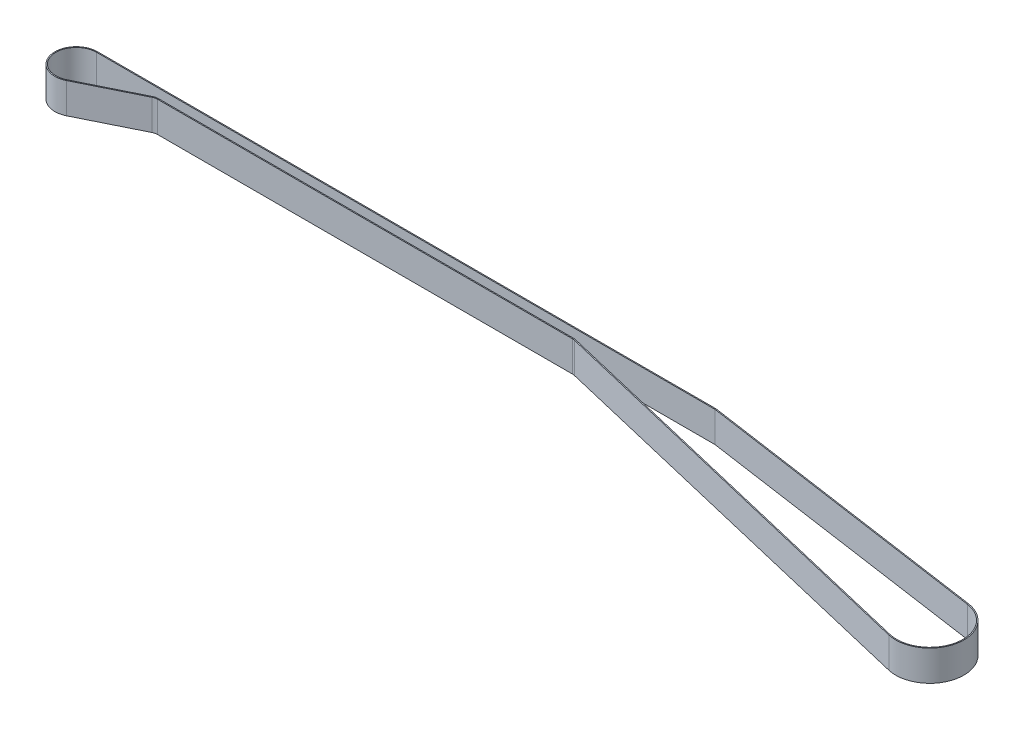
ISO-10303-21;
HEADER;
FILE_DESCRIPTION(('STEP AP214'),'2;1');
FILE_NAME('part.step','',(''),(''),'','','');
FILE_SCHEMA(('AUTOMOTIVE_DESIGN { 1 0 10303 214 1 1 1 1 }'));
ENDSEC;
DATA;
#1=APPLICATION_CONTEXT('core data for automotive mechanical design processes');
#2=APPLICATION_PROTOCOL_DEFINITION('international standard','automotive_design',2000,#1);
#3=PRODUCT_CONTEXT('',#1,'mechanical');
#4=PRODUCT('Part','Part','',(#3));
#5=PRODUCT_RELATED_PRODUCT_CATEGORY('part','',(#4));
#6=PRODUCT_DEFINITION_FORMATION('','',#4);
#7=PRODUCT_DEFINITION_CONTEXT('part definition',#1,'design');
#8=PRODUCT_DEFINITION('design','',#6,#7);
#9=PRODUCT_DEFINITION_SHAPE('','',#8);
#10=(LENGTH_UNIT() NAMED_UNIT(*) SI_UNIT(.MILLI.,.METRE.));
#11=(NAMED_UNIT(*) PLANE_ANGLE_UNIT() SI_UNIT($,.RADIAN.));
#12=(NAMED_UNIT(*) SI_UNIT($,.STERADIAN.) SOLID_ANGLE_UNIT());
#13=UNCERTAINTY_MEASURE_WITH_UNIT(LENGTH_MEASURE(1.E-05),#10,'distance_accuracy_value','');
#14=(GEOMETRIC_REPRESENTATION_CONTEXT(3) GLOBAL_UNCERTAINTY_ASSIGNED_CONTEXT((#13)) GLOBAL_UNIT_ASSIGNED_CONTEXT((#10,
#11,#12)) REPRESENTATION_CONTEXT('',''));
#15=CARTESIAN_POINT('',(0.,0.,0.));
#16=DIRECTION('',(0.,0.,1.));
#17=DIRECTION('',(1.,0.,0.));
#18=AXIS2_PLACEMENT_3D('',#15,#16,#17);
#19=CARTESIAN_POINT('',(0.,15.,0.));
#20=DIRECTION('',(0.,1.,0.));
#21=DIRECTION('',(0.,0.,1.));
#22=AXIS2_PLACEMENT_3D('',#19,#20,#21);
#23=PLANE('',#22);
#24=CARTESIAN_POINT('',(0.,15.,0.));
#25=DIRECTION('',(0.,1.,0.));
#26=DIRECTION('',(0.,0.,1.));
#27=AXIS2_PLACEMENT_3D('',#24,#25,#26);
#28=CIRCLE('',#27,10.5);
#29=CARTESIAN_POINT('',(0.,15.,-10.5));
#30=VERTEX_POINT('',#29);
#31=CARTESIAN_POINT('',(4.65,15.,9.41421797070792));
#32=VERTEX_POINT('',#31);
#33=EDGE_CURVE('E230',#30,#32,#28,.T.);
#34=ORIENTED_EDGE('',*,*,#33,.T.);
#35=DIRECTION('',(0.896592187686469,0.,-0.442857142857143));
#36=VECTOR('',#35,1.);
#37=CARTESIAN_POINT('',(4.65,15.,9.41421797070792));
#38=LINE('',#37,#36);
#39=CARTESIAN_POINT('',(32.7857142857143,15.,-4.48296093843234));
#40=VERTEX_POINT('',#39);
#41=EDGE_CURVE('E233',#32,#40,#38,.T.);
#42=ORIENTED_EDGE('',*,*,#41,.T.);
#43=CARTESIAN_POINT('',(35.,15.,0.));
#44=DIRECTION('',(0.,-1.,0.));
#45=DIRECTION('',(0.,0.,1.));
#46=AXIS2_PLACEMENT_3D('',#43,#44,#45);
#47=CIRCLE('',#46,5.);
#48=CARTESIAN_POINT('',(35.,15.,-5.));
#49=VERTEX_POINT('',#48);
#50=EDGE_CURVE('E236',#40,#49,#47,.T.);
#51=ORIENTED_EDGE('',*,*,#50,.T.);
#52=DIRECTION('',(1.,0.,0.));
#53=VECTOR('',#52,1.);
#54=CARTESIAN_POINT('',(35.,15.,-5.));
#55=LINE('',#54,#53);
#56=CARTESIAN_POINT('',(238.84,15.,-4.99999999999999));
#57=VERTEX_POINT('',#56);
#58=EDGE_CURVE('E238',#49,#57,#55,.T.);
#59=ORIENTED_EDGE('',*,*,#58,.T.);
#60=CARTESIAN_POINT('',(238.84,15.,0.));
#61=DIRECTION('',(0.,-1.,0.));
#62=DIRECTION('',(0.,0.,1.));
#63=AXIS2_PLACEMENT_3D('',#60,#61,#62);
#64=CIRCLE('',#63,4.99999999999999);
#65=CARTESIAN_POINT('',(239.996066619357,15.,-4.86451538918415));
#66=VERTEX_POINT('',#65);
#67=EDGE_CURVE('E240',#57,#66,#64,.T.);
#68=ORIENTED_EDGE('',*,*,#67,.T.);
#69=DIRECTION('',(0.972903077836831,0.,0.231213323871314));
#70=VECTOR('',#69,1.);
#71=CARTESIAN_POINT('',(239.996066619357,15.,-4.86451538918415));
#72=LINE('',#71,#70);
#73=CARTESIAN_POINT('',(442.647176825156,15.,43.2961265537669));
#74=VERTEX_POINT('',#73);
#75=EDGE_CURVE('E242',#66,#74,#72,.T.);
#76=ORIENTED_EDGE('',*,*,#75,.T.);
#77=CARTESIAN_POINT('',(446.52,15.,27.));
#78=DIRECTION('',(0.,1.,0.));
#79=DIRECTION('',(0.,0.,1.));
#80=AXIS2_PLACEMENT_3D('',#77,#78,#79);
#81=CIRCLE('',#80,16.75);
#82=CARTESIAN_POINT('',(448.913075842957,15.,10.4218309813824));
#83=VERTEX_POINT('',#82);
#84=EDGE_CURVE('E244',#74,#83,#81,.T.);
#85=ORIENTED_EDGE('',*,*,#84,.T.);
#86=DIRECTION('',(-0.989741433947323,0.,-0.142870199579541));
#87=VECTOR('',#86,1.);
#88=CARTESIAN_POINT('',(303.975901699875,15.,-10.5));
#89=LINE('',#88,#87);
#90=CARTESIAN_POINT('',(303.975901699875,15.,-10.5));
#91=VERTEX_POINT('',#90);
#92=EDGE_CURVE('E246',#83,#91,#89,.T.);
#93=ORIENTED_EDGE('',*,*,#92,.T.);
#94=DIRECTION('',(-1.,0.,0.));
#95=VECTOR('',#94,1.);
#96=CARTESIAN_POINT('',(0.,15.,-10.5));
#97=LINE('',#96,#95);
#98=EDGE_CURVE('E248',#91,#30,#97,.T.);
#99=ORIENTED_EDGE('',*,*,#98,.T.);
#100=EDGE_LOOP('',(#34,#42,#51,#59,#68,#76,#85,#93,#99));
#101=FACE_BOUND('',#100,.T.);
#102=DIRECTION('',(0.896592187686469,0.,-0.442857142857143));
#103=VECTOR('',#102,1.);
#104=CARTESIAN_POINT('',(4.42857142857143,15.,8.96592187686469));
#105=LINE('',#104,#103);
#106=CARTESIAN_POINT('',(4.42857142857143,15.,8.96592187686469));
#107=VERTEX_POINT('',#106);
#108=CARTESIAN_POINT('',(32.5642857142857,15.,-4.93125703227558));
#109=VERTEX_POINT('',#108);
#110=EDGE_CURVE('E166',#107,#109,#105,.T.);
#111=ORIENTED_EDGE('',*,*,#110,.F.);
#112=CARTESIAN_POINT('',(0.,15.,0.));
#113=DIRECTION('',(0.,1.,0.));
#114=DIRECTION('',(0.,0.,1.));
#115=AXIS2_PLACEMENT_3D('',#112,#113,#114);
#116=CIRCLE('',#115,10.);
#117=CARTESIAN_POINT('',(0.,15.,-10.));
#118=VERTEX_POINT('',#117);
#119=EDGE_CURVE('E158',#118,#107,#116,.T.);
#120=ORIENTED_EDGE('',*,*,#119,.F.);
#121=DIRECTION('',(-1.,0.,0.));
#122=VECTOR('',#121,1.);
#123=CARTESIAN_POINT('',(0.,15.,-10.));
#124=LINE('',#123,#122);
#125=CARTESIAN_POINT('',(303.94,15.,-10.));
#126=VERTEX_POINT('',#125);
#127=EDGE_CURVE('E193',#126,#118,#124,.T.);
#128=ORIENTED_EDGE('',*,*,#127,.F.);
#129=DIRECTION('',(-0.989741433947323,0.,-0.142870199579541));
#130=VECTOR('',#129,1.);
#131=CARTESIAN_POINT('',(303.94,15.,-10.));
#132=LINE('',#131,#130);
#133=CARTESIAN_POINT('',(448.841640743168,15.,10.916701698356));
#134=VERTEX_POINT('',#133);
#135=EDGE_CURVE('E191',#134,#126,#132,.T.);
#136=ORIENTED_EDGE('',*,*,#135,.F.);
#137=CARTESIAN_POINT('',(446.52,15.,27.));
#138=DIRECTION('',(0.,1.,0.));
#139=DIRECTION('',(0.,0.,1.));
#140=AXIS2_PLACEMENT_3D('',#137,#138,#139);
#141=CIRCLE('',#140,16.25);
#142=CARTESIAN_POINT('',(442.762783487091,15.,42.8096750148485));
#143=VERTEX_POINT('',#142);
#144=EDGE_CURVE('E189',#143,#134,#141,.T.);
#145=ORIENTED_EDGE('',*,*,#144,.F.);
#146=DIRECTION('',(0.972903077836831,0.,0.231213323871314));
#147=VECTOR('',#146,1.);
#148=CARTESIAN_POINT('',(240.111673281292,15.,-5.35096692810256));
#149=LINE('',#148,#147);
#150=CARTESIAN_POINT('',(240.111673281292,15.,-5.35096692810256));
#151=VERTEX_POINT('',#150);
#152=EDGE_CURVE('E187',#151,#143,#149,.T.);
#153=ORIENTED_EDGE('',*,*,#152,.F.);
#154=CARTESIAN_POINT('',(238.84,15.,0.));
#155=DIRECTION('',(0.,-1.,0.));
#156=DIRECTION('',(0.,0.,1.));
#157=AXIS2_PLACEMENT_3D('',#154,#155,#156);
#158=CIRCLE('',#157,5.49999999999999);
#159=CARTESIAN_POINT('',(238.84,15.,-5.49999999999999));
#160=VERTEX_POINT('',#159);
#161=EDGE_CURVE('E185',#160,#151,#158,.T.);
#162=ORIENTED_EDGE('',*,*,#161,.F.);
#163=DIRECTION('',(1.,0.,0.));
#164=VECTOR('',#163,1.);
#165=CARTESIAN_POINT('',(35.,15.,-5.5));
#166=LINE('',#165,#164);
#167=CARTESIAN_POINT('',(35.,15.,-5.5));
#168=VERTEX_POINT('',#167);
#169=EDGE_CURVE('E181',#168,#160,#166,.T.);
#170=ORIENTED_EDGE('',*,*,#169,.F.);
#171=CARTESIAN_POINT('',(35.,15.,0.));
#172=DIRECTION('',(0.,-1.,0.));
#173=DIRECTION('',(0.,0.,1.));
#174=AXIS2_PLACEMENT_3D('',#171,#172,#173);
#175=CIRCLE('',#174,5.5);
#176=EDGE_CURVE('E179',#109,#168,#175,.T.);
#177=ORIENTED_EDGE('',*,*,#176,.F.);
#178=EDGE_LOOP('',(#111,#120,#128,#136,#145,#153,#162,#170,#177));
#179=FACE_BOUND('',#178,.T.);
#180=ADVANCED_FACE('F33',(#101,#179),#23,.T.);
#181=CARTESIAN_POINT('',(0.,0.,0.));
#182=DIRECTION('',(0.,1.,0.));
#183=DIRECTION('',(0.,0.,1.));
#184=AXIS2_PLACEMENT_3D('',#181,#182,#183);
#185=PLANE('',#184);
#186=CARTESIAN_POINT('',(0.,0.,0.));
#187=DIRECTION('',(0.,1.,0.));
#188=DIRECTION('',(0.,0.,1.));
#189=AXIS2_PLACEMENT_3D('',#186,#187,#188);
#190=CIRCLE('',#189,10.5);
#191=CARTESIAN_POINT('',(0.,0.,-10.5));
#192=VERTEX_POINT('',#191);
#193=CARTESIAN_POINT('',(4.65,0.,9.41421797070792));
#194=VERTEX_POINT('',#193);
#195=EDGE_CURVE('E174',#192,#194,#190,.T.);
#196=ORIENTED_EDGE('',*,*,#195,.F.);
#197=DIRECTION('',(-1.,0.,0.));
#198=VECTOR('',#197,1.);
#199=CARTESIAN_POINT('',(0.,0.,-10.5));
#200=LINE('',#199,#198);
#201=CARTESIAN_POINT('',(303.975901699875,0.,-10.5));
#202=VERTEX_POINT('',#201);
#203=EDGE_CURVE('E234',#202,#192,#200,.T.);
#204=ORIENTED_EDGE('',*,*,#203,.F.);
#205=DIRECTION('',(-0.989741433947323,0.,-0.142870199579541));
#206=VECTOR('',#205,1.);
#207=CARTESIAN_POINT('',(303.975901699875,0.,-10.5));
#208=LINE('',#207,#206);
#209=CARTESIAN_POINT('',(448.913075842957,0.,10.4218309813824));
#210=VERTEX_POINT('',#209);
#211=EDGE_CURVE('E265',#210,#202,#208,.T.);
#212=ORIENTED_EDGE('',*,*,#211,.F.);
#213=CARTESIAN_POINT('',(446.52,0.,27.));
#214=DIRECTION('',(0.,1.,0.));
#215=DIRECTION('',(0.,0.,1.));
#216=AXIS2_PLACEMENT_3D('',#213,#214,#215);
#217=CIRCLE('',#216,16.75);
#218=CARTESIAN_POINT('',(442.647176825156,0.,43.2961265537669));
#219=VERTEX_POINT('',#218);
#220=EDGE_CURVE('E263',#219,#210,#217,.T.);
#221=ORIENTED_EDGE('',*,*,#220,.F.);
#222=DIRECTION('',(0.972903077836831,0.,0.231213323871314));
#223=VECTOR('',#222,1.);
#224=CARTESIAN_POINT('',(239.996066619357,0.,-4.86451538918415));
#225=LINE('',#224,#223);
#226=CARTESIAN_POINT('',(239.996066619357,0.,-4.86451538918415));
#227=VERTEX_POINT('',#226);
#228=EDGE_CURVE('E261',#227,#219,#225,.T.);
#229=ORIENTED_EDGE('',*,*,#228,.F.);
#230=CARTESIAN_POINT('',(238.84,0.,0.));
#231=DIRECTION('',(0.,-1.,0.));
#232=DIRECTION('',(0.,0.,1.));
#233=AXIS2_PLACEMENT_3D('',#230,#231,#232);
#234=CIRCLE('',#233,4.99999999999999);
#235=CARTESIAN_POINT('',(238.84,0.,-4.99999999999999));
#236=VERTEX_POINT('',#235);
#237=EDGE_CURVE('E259',#236,#227,#234,.T.);
#238=ORIENTED_EDGE('',*,*,#237,.F.);
#239=DIRECTION('',(1.,0.,0.));
#240=VECTOR('',#239,1.);
#241=CARTESIAN_POINT('',(35.,0.,-5.));
#242=LINE('',#241,#240);
#243=CARTESIAN_POINT('',(35.,0.,-5.));
#244=VERTEX_POINT('',#243);
#245=EDGE_CURVE('E257',#244,#236,#242,.T.);
#246=ORIENTED_EDGE('',*,*,#245,.F.);
#247=CARTESIAN_POINT('',(35.,0.,0.));
#248=DIRECTION('',(0.,-1.,0.));
#249=DIRECTION('',(0.,0.,1.));
#250=AXIS2_PLACEMENT_3D('',#247,#248,#249);
#251=CIRCLE('',#250,5.);
#252=CARTESIAN_POINT('',(32.7857142857143,0.,-4.48296093843234));
#253=VERTEX_POINT('',#252);
#254=EDGE_CURVE('E255',#253,#244,#251,.T.);
#255=ORIENTED_EDGE('',*,*,#254,.F.);
#256=DIRECTION('',(0.896592187686469,0.,-0.442857142857143));
#257=VECTOR('',#256,1.);
#258=CARTESIAN_POINT('',(4.65,0.,9.41421797070792));
#259=LINE('',#258,#257);
#260=EDGE_CURVE('E253',#194,#253,#259,.T.);
#261=ORIENTED_EDGE('',*,*,#260,.F.);
#262=EDGE_LOOP('',(#196,#204,#212,#221,#229,#238,#246,#255,#261));
#263=FACE_BOUND('',#262,.T.);
#264=CARTESIAN_POINT('',(0.,0.,0.));
#265=DIRECTION('',(0.,1.,0.));
#266=DIRECTION('',(0.,0.,1.));
#267=AXIS2_PLACEMENT_3D('',#264,#265,#266);
#268=CIRCLE('',#267,10.);
#269=CARTESIAN_POINT('',(0.,0.,-10.));
#270=VERTEX_POINT('',#269);
#271=CARTESIAN_POINT('',(4.42857142857143,0.,8.96592187686469));
#272=VERTEX_POINT('',#271);
#273=EDGE_CURVE('E56',#270,#272,#268,.T.);
#274=ORIENTED_EDGE('',*,*,#273,.T.);
#275=DIRECTION('',(0.896592187686469,0.,-0.442857142857143));
#276=VECTOR('',#275,1.);
#277=CARTESIAN_POINT('',(4.42857142857143,0.,8.96592187686469));
#278=LINE('',#277,#276);
#279=CARTESIAN_POINT('',(32.5642857142857,0.,-4.93125703227558));
#280=VERTEX_POINT('',#279);
#281=EDGE_CURVE('E173',#272,#280,#278,.T.);
#282=ORIENTED_EDGE('',*,*,#281,.T.);
#283=CARTESIAN_POINT('',(35.,0.,0.));
#284=DIRECTION('',(0.,-1.,0.));
#285=DIRECTION('',(0.,0.,1.));
#286=AXIS2_PLACEMENT_3D('',#283,#284,#285);
#287=CIRCLE('',#286,5.5);
#288=CARTESIAN_POINT('',(35.,0.,-5.5));
#289=VERTEX_POINT('',#288);
#290=EDGE_CURVE('E197',#280,#289,#287,.T.);
#291=ORIENTED_EDGE('',*,*,#290,.T.);
#292=DIRECTION('',(1.,0.,0.));
#293=VECTOR('',#292,1.);
#294=CARTESIAN_POINT('',(35.,0.,-5.5));
#295=LINE('',#294,#293);
#296=CARTESIAN_POINT('',(238.84,0.,-5.49999999999999));
#297=VERTEX_POINT('',#296);
#298=EDGE_CURVE('E200',#289,#297,#295,.T.);
#299=ORIENTED_EDGE('',*,*,#298,.T.);
#300=CARTESIAN_POINT('',(238.84,0.,0.));
#301=DIRECTION('',(0.,-1.,0.));
#302=DIRECTION('',(0.,0.,1.));
#303=AXIS2_PLACEMENT_3D('',#300,#301,#302);
#304=CIRCLE('',#303,5.49999999999999);
#305=CARTESIAN_POINT('',(240.111673281292,0.,-5.35096692810256));
#306=VERTEX_POINT('',#305);
#307=EDGE_CURVE('E203',#297,#306,#304,.T.);
#308=ORIENTED_EDGE('',*,*,#307,.T.);
#309=DIRECTION('',(0.972903077836831,0.,0.231213323871314));
#310=VECTOR('',#309,1.);
#311=CARTESIAN_POINT('',(240.111673281292,0.,-5.35096692810256));
#312=LINE('',#311,#310);
#313=CARTESIAN_POINT('',(442.762783487091,0.,42.8096750148485));
#314=VERTEX_POINT('',#313);
#315=EDGE_CURVE('E206',#306,#314,#312,.T.);
#316=ORIENTED_EDGE('',*,*,#315,.T.);
#317=CARTESIAN_POINT('',(446.52,0.,27.));
#318=DIRECTION('',(0.,1.,0.));
#319=DIRECTION('',(0.,0.,1.));
#320=AXIS2_PLACEMENT_3D('',#317,#318,#319);
#321=CIRCLE('',#320,16.25);
#322=CARTESIAN_POINT('',(448.841640743168,0.,10.916701698356));
#323=VERTEX_POINT('',#322);
#324=EDGE_CURVE('E209',#314,#323,#321,.T.);
#325=ORIENTED_EDGE('',*,*,#324,.T.);
#326=DIRECTION('',(-0.989741433947323,0.,-0.142870199579541));
#327=VECTOR('',#326,1.);
#328=CARTESIAN_POINT('',(303.94,0.,-10.));
#329=LINE('',#328,#327);
#330=CARTESIAN_POINT('',(303.94,0.,-10.));
#331=VERTEX_POINT('',#330);
#332=EDGE_CURVE('E212',#323,#331,#329,.T.);
#333=ORIENTED_EDGE('',*,*,#332,.T.);
#334=DIRECTION('',(-1.,0.,0.));
#335=VECTOR('',#334,1.);
#336=CARTESIAN_POINT('',(0.,0.,-10.));
#337=LINE('',#336,#335);
#338=EDGE_CURVE('E167',#331,#270,#337,.T.);
#339=ORIENTED_EDGE('',*,*,#338,.T.);
#340=EDGE_LOOP('',(#274,#282,#291,#299,#308,#316,#325,#333,#339));
#341=FACE_BOUND('',#340,.T.);
#342=ADVANCED_FACE('F298',(#263,#341),#185,.F.);
#343=CARTESIAN_POINT('',(0.,15.,0.));
#344=DIRECTION('',(0.,-1.,0.));
#345=DIRECTION('',(0.,0.,-1.));
#346=AXIS2_PLACEMENT_3D('',#343,#344,#345);
#347=CYLINDRICAL_SURFACE('',#346,10.5);
#348=ORIENTED_EDGE('',*,*,#195,.T.);
#349=DIRECTION('',(0.,-1.,0.));
#350=VECTOR('',#349,1.);
#351=CARTESIAN_POINT('',(4.65,15.,9.41421797070792));
#352=LINE('',#351,#350);
#353=EDGE_CURVE('E11',#32,#194,#352,.T.);
#354=ORIENTED_EDGE('',*,*,#353,.F.);
#355=ORIENTED_EDGE('',*,*,#33,.F.);
#356=DIRECTION('',(0.,-1.,0.));
#357=VECTOR('',#356,1.);
#358=CARTESIAN_POINT('',(0.,15.,-10.5));
#359=LINE('',#358,#357);
#360=EDGE_CURVE('E250',#30,#192,#359,.T.);
#361=ORIENTED_EDGE('',*,*,#360,.T.);
#362=EDGE_LOOP('',(#348,#354,#355,#361));
#363=FACE_BOUND('',#362,.T.);
#364=ADVANCED_FACE('F35',(#363),#347,.T.);
#365=CARTESIAN_POINT('',(4.65,15.,9.41421797070792));
#366=DIRECTION('',(-0.442857142857143,0.,-0.896592187686469));
#367=DIRECTION('',(-0.896592187686469,0.,0.442857142857143));
#368=AXIS2_PLACEMENT_3D('',#365,#366,#367);
#369=PLANE('',#368);
#370=ORIENTED_EDGE('',*,*,#260,.T.);
#371=DIRECTION('',(0.,-1.,0.));
#372=VECTOR('',#371,1.);
#373=CARTESIAN_POINT('',(32.7857142857143,15.,-4.48296093843234));
#374=LINE('',#373,#372);
#375=EDGE_CURVE('E41',#40,#253,#374,.T.);
#376=ORIENTED_EDGE('',*,*,#375,.F.);
#377=ORIENTED_EDGE('',*,*,#41,.F.);
#378=ORIENTED_EDGE('',*,*,#353,.T.);
#379=EDGE_LOOP('',(#370,#376,#377,#378));
#380=FACE_BOUND('',#379,.T.);
#381=ADVANCED_FACE('F315',(#380),#369,.F.);
#382=CARTESIAN_POINT('',(35.,15.,0.));
#383=DIRECTION('',(0.,-1.,0.));
#384=DIRECTION('',(0.,0.,-1.));
#385=AXIS2_PLACEMENT_3D('',#382,#383,#384);
#386=CYLINDRICAL_SURFACE('',#385,5.);
#387=ORIENTED_EDGE('',*,*,#254,.T.);
#388=DIRECTION('',(0.,-1.,0.));
#389=VECTOR('',#388,1.);
#390=CARTESIAN_POINT('',(35.,15.,-5.));
#391=LINE('',#390,#389);
#392=EDGE_CURVE('E285',#49,#244,#391,.T.);
#393=ORIENTED_EDGE('',*,*,#392,.F.);
#394=ORIENTED_EDGE('',*,*,#50,.F.);
#395=ORIENTED_EDGE('',*,*,#375,.T.);
#396=EDGE_LOOP('',(#387,#393,#394,#395));
#397=FACE_BOUND('',#396,.T.);
#398=ADVANCED_FACE('F292',(#397),#386,.F.);
#399=CARTESIAN_POINT('',(35.,15.,-5.));
#400=DIRECTION('',(0.,0.,-1.));
#401=DIRECTION('',(-1.,0.,0.));
#402=AXIS2_PLACEMENT_3D('',#399,#400,#401);
#403=PLANE('',#402);
#404=ORIENTED_EDGE('',*,*,#245,.T.);
#405=DIRECTION('',(0.,-1.,0.));
#406=VECTOR('',#405,1.);
#407=CARTESIAN_POINT('',(238.84,15.,-4.99999999999999));
#408=LINE('',#407,#406);
#409=EDGE_CURVE('E282',#57,#236,#408,.T.);
#410=ORIENTED_EDGE('',*,*,#409,.F.);
#411=ORIENTED_EDGE('',*,*,#58,.F.);
#412=ORIENTED_EDGE('',*,*,#392,.T.);
#413=EDGE_LOOP('',(#404,#410,#411,#412));
#414=FACE_BOUND('',#413,.T.);
#415=ADVANCED_FACE('F304',(#414),#403,.F.);
#416=CARTESIAN_POINT('',(238.84,15.,0.));
#417=DIRECTION('',(0.,-1.,0.));
#418=DIRECTION('',(0.,0.,-1.));
#419=AXIS2_PLACEMENT_3D('',#416,#417,#418);
#420=CYLINDRICAL_SURFACE('',#419,4.99999999999999);
#421=ORIENTED_EDGE('',*,*,#237,.T.);
#422=DIRECTION('',(0.,-1.,0.));
#423=VECTOR('',#422,1.);
#424=CARTESIAN_POINT('',(239.996066619357,15.,-4.86451538918415));
#425=LINE('',#424,#423);
#426=EDGE_CURVE('E279',#66,#227,#425,.T.);
#427=ORIENTED_EDGE('',*,*,#426,.F.);
#428=ORIENTED_EDGE('',*,*,#67,.F.);
#429=ORIENTED_EDGE('',*,*,#409,.T.);
#430=EDGE_LOOP('',(#421,#427,#428,#429));
#431=FACE_BOUND('',#430,.T.);
#432=ADVANCED_FACE('F308',(#431),#420,.F.);
#433=CARTESIAN_POINT('',(239.996066619357,15.,-4.86451538918415));
#434=DIRECTION('',(0.231213323871314,0.,-0.972903077836831));
#435=DIRECTION('',(-0.972903077836831,0.,-0.231213323871314));
#436=AXIS2_PLACEMENT_3D('',#433,#434,#435);
#437=PLANE('',#436);
#438=ORIENTED_EDGE('',*,*,#228,.T.);
#439=DIRECTION('',(0.,-1.,0.));
#440=VECTOR('',#439,1.);
#441=CARTESIAN_POINT('',(442.647176825156,15.,43.2961265537669));
#442=LINE('',#441,#440);
#443=EDGE_CURVE('E276',#74,#219,#442,.T.);
#444=ORIENTED_EDGE('',*,*,#443,.F.);
#445=ORIENTED_EDGE('',*,*,#75,.F.);
#446=ORIENTED_EDGE('',*,*,#426,.T.);
#447=EDGE_LOOP('',(#438,#444,#445,#446));
#448=FACE_BOUND('',#447,.T.);
#449=ADVANCED_FACE('F333',(#448),#437,.F.);
#450=CARTESIAN_POINT('',(446.52,15.,27.));
#451=DIRECTION('',(0.,-1.,0.));
#452=DIRECTION('',(0.,0.,-1.));
#453=AXIS2_PLACEMENT_3D('',#450,#451,#452);
#454=CYLINDRICAL_SURFACE('',#453,16.75);
#455=ORIENTED_EDGE('',*,*,#220,.T.);
#456=DIRECTION('',(0.,-1.,0.));
#457=VECTOR('',#456,1.);
#458=CARTESIAN_POINT('',(448.913075842957,15.,10.4218309813824));
#459=LINE('',#458,#457);
#460=EDGE_CURVE('E273',#83,#210,#459,.T.);
#461=ORIENTED_EDGE('',*,*,#460,.F.);
#462=ORIENTED_EDGE('',*,*,#84,.F.);
#463=ORIENTED_EDGE('',*,*,#443,.T.);
#464=EDGE_LOOP('',(#455,#461,#462,#463));
#465=FACE_BOUND('',#464,.T.);
#466=ADVANCED_FACE('F331',(#465),#454,.T.);
#467=CARTESIAN_POINT('',(303.975901699875,15.,-10.5));
#468=DIRECTION('',(-0.142870199579541,0.,0.989741433947322));
#469=DIRECTION('',(0.989741433947323,0.,0.142870199579541));
#470=AXIS2_PLACEMENT_3D('',#467,#468,#469);
#471=PLANE('',#470);
#472=ORIENTED_EDGE('',*,*,#211,.T.);
#473=DIRECTION('',(0.,-1.,0.));
#474=VECTOR('',#473,1.);
#475=CARTESIAN_POINT('',(303.975901699875,15.,-10.5));
#476=LINE('',#475,#474);
#477=EDGE_CURVE('E270',#91,#202,#476,.T.);
#478=ORIENTED_EDGE('',*,*,#477,.F.);
#479=ORIENTED_EDGE('',*,*,#92,.F.);
#480=ORIENTED_EDGE('',*,*,#460,.T.);
#481=EDGE_LOOP('',(#472,#478,#479,#480));
#482=FACE_BOUND('',#481,.T.);
#483=ADVANCED_FACE('F327',(#482),#471,.F.);
#484=CARTESIAN_POINT('',(0.,15.,-10.5));
#485=DIRECTION('',(0.,0.,1.));
#486=DIRECTION('',(1.,0.,0.));
#487=AXIS2_PLACEMENT_3D('',#484,#485,#486);
#488=PLANE('',#487);
#489=ORIENTED_EDGE('',*,*,#203,.T.);
#490=ORIENTED_EDGE('',*,*,#360,.F.);
#491=ORIENTED_EDGE('',*,*,#98,.F.);
#492=ORIENTED_EDGE('',*,*,#477,.T.);
#493=EDGE_LOOP('',(#489,#490,#491,#492));
#494=FACE_BOUND('',#493,.T.);
#495=ADVANCED_FACE('F322',(#494),#488,.F.);
#496=CARTESIAN_POINT('',(0.,15.,0.));
#497=DIRECTION('',(0.,-1.,0.));
#498=DIRECTION('',(0.,0.,-1.));
#499=AXIS2_PLACEMENT_3D('',#496,#497,#498);
#500=CYLINDRICAL_SURFACE('',#499,10.);
#501=ORIENTED_EDGE('',*,*,#273,.F.);
#502=DIRECTION('',(0.,-1.,0.));
#503=VECTOR('',#502,1.);
#504=CARTESIAN_POINT('',(0.,15.,-10.));
#505=LINE('',#504,#503);
#506=EDGE_CURVE('E162',#118,#270,#505,.T.);
#507=ORIENTED_EDGE('',*,*,#506,.F.);
#508=ORIENTED_EDGE('',*,*,#119,.T.);
#509=DIRECTION('',(0.,-1.,0.));
#510=VECTOR('',#509,1.);
#511=CARTESIAN_POINT('',(4.42857142857143,15.,8.96592187686469));
#512=LINE('',#511,#510);
#513=EDGE_CURVE('E161',#107,#272,#512,.T.);
#514=ORIENTED_EDGE('',*,*,#513,.T.);
#515=EDGE_LOOP('',(#501,#507,#508,#514));
#516=FACE_BOUND('',#515,.T.);
#517=ADVANCED_FACE('F160',(#516),#500,.F.);
#518=CARTESIAN_POINT('',(4.42857142857143,15.,8.96592187686469));
#519=DIRECTION('',(-0.442857142857143,0.,-0.896592187686469));
#520=DIRECTION('',(-0.896592187686469,0.,0.442857142857143));
#521=AXIS2_PLACEMENT_3D('',#518,#519,#520);
#522=PLANE('',#521);
#523=ORIENTED_EDGE('',*,*,#281,.F.);
#524=ORIENTED_EDGE('',*,*,#513,.F.);
#525=ORIENTED_EDGE('',*,*,#110,.T.);
#526=DIRECTION('',(0.,-1.,0.));
#527=VECTOR('',#526,1.);
#528=CARTESIAN_POINT('',(32.5642857142857,15.,-4.93125703227558));
#529=LINE('',#528,#527);
#530=EDGE_CURVE('E175',#109,#280,#529,.T.);
#531=ORIENTED_EDGE('',*,*,#530,.T.);
#532=EDGE_LOOP('',(#523,#524,#525,#531));
#533=FACE_BOUND('',#532,.T.);
#534=ADVANCED_FACE('F170',(#533),#522,.T.);
#535=CARTESIAN_POINT('',(35.,15.,0.));
#536=DIRECTION('',(0.,-1.,0.));
#537=DIRECTION('',(0.,0.,-1.));
#538=AXIS2_PLACEMENT_3D('',#535,#536,#537);
#539=CYLINDRICAL_SURFACE('',#538,5.5);
#540=ORIENTED_EDGE('',*,*,#290,.F.);
#541=ORIENTED_EDGE('',*,*,#530,.F.);
#542=ORIENTED_EDGE('',*,*,#176,.T.);
#543=DIRECTION('',(0.,-1.,0.));
#544=VECTOR('',#543,1.);
#545=CARTESIAN_POINT('',(35.,15.,-5.5));
#546=LINE('',#545,#544);
#547=EDGE_CURVE('E227',#168,#289,#546,.T.);
#548=ORIENTED_EDGE('',*,*,#547,.T.);
#549=EDGE_LOOP('',(#540,#541,#542,#548));
#550=FACE_BOUND('',#549,.T.);
#551=ADVANCED_FACE('F373',(#550),#539,.T.);
#552=CARTESIAN_POINT('',(35.,15.,-5.5));
#553=DIRECTION('',(0.,0.,-1.));
#554=DIRECTION('',(-1.,0.,0.));
#555=AXIS2_PLACEMENT_3D('',#552,#553,#554);
#556=PLANE('',#555);
#557=ORIENTED_EDGE('',*,*,#298,.F.);
#558=ORIENTED_EDGE('',*,*,#547,.F.);
#559=ORIENTED_EDGE('',*,*,#169,.T.);
#560=DIRECTION('',(0.,-1.,0.));
#561=VECTOR('',#560,1.);
#562=CARTESIAN_POINT('',(238.84,15.,-5.49999999999999));
#563=LINE('',#562,#561);
#564=EDGE_CURVE('E225',#160,#297,#563,.T.);
#565=ORIENTED_EDGE('',*,*,#564,.T.);
#566=EDGE_LOOP('',(#557,#558,#559,#565));
#567=FACE_BOUND('',#566,.T.);
#568=ADVANCED_FACE('F379',(#567),#556,.T.);
#569=CARTESIAN_POINT('',(238.84,15.,0.));
#570=DIRECTION('',(0.,-1.,0.));
#571=DIRECTION('',(0.,0.,-1.));
#572=AXIS2_PLACEMENT_3D('',#569,#570,#571);
#573=CYLINDRICAL_SURFACE('',#572,5.49999999999999);
#574=ORIENTED_EDGE('',*,*,#307,.F.);
#575=ORIENTED_EDGE('',*,*,#564,.F.);
#576=ORIENTED_EDGE('',*,*,#161,.T.);
#577=DIRECTION('',(0.,-1.,0.));
#578=VECTOR('',#577,1.);
#579=CARTESIAN_POINT('',(240.111673281292,15.,-5.35096692810256));
#580=LINE('',#579,#578);
#581=EDGE_CURVE('E223',#151,#306,#580,.T.);
#582=ORIENTED_EDGE('',*,*,#581,.T.);
#583=EDGE_LOOP('',(#574,#575,#576,#582));
#584=FACE_BOUND('',#583,.T.);
#585=ADVANCED_FACE('F387',(#584),#573,.T.);
#586=CARTESIAN_POINT('',(240.111673281292,15.,-5.35096692810256));
#587=DIRECTION('',(0.231213323871314,0.,-0.972903077836831));
#588=DIRECTION('',(-0.972903077836831,0.,-0.231213323871314));
#589=AXIS2_PLACEMENT_3D('',#586,#587,#588);
#590=PLANE('',#589);
#591=ORIENTED_EDGE('',*,*,#315,.F.);
#592=ORIENTED_EDGE('',*,*,#581,.F.);
#593=ORIENTED_EDGE('',*,*,#152,.T.);
#594=DIRECTION('',(0.,-1.,0.));
#595=VECTOR('',#594,1.);
#596=CARTESIAN_POINT('',(442.762783487091,15.,42.8096750148485));
#597=LINE('',#596,#595);
#598=EDGE_CURVE('E221',#143,#314,#597,.T.);
#599=ORIENTED_EDGE('',*,*,#598,.T.);
#600=EDGE_LOOP('',(#591,#592,#593,#599));
#601=FACE_BOUND('',#600,.T.);
#602=ADVANCED_FACE('F395',(#601),#590,.T.);
#603=CARTESIAN_POINT('',(446.52,15.,27.));
#604=DIRECTION('',(0.,-1.,0.));
#605=DIRECTION('',(0.,0.,-1.));
#606=AXIS2_PLACEMENT_3D('',#603,#604,#605);
#607=CYLINDRICAL_SURFACE('',#606,16.25);
#608=ORIENTED_EDGE('',*,*,#324,.F.);
#609=ORIENTED_EDGE('',*,*,#598,.F.);
#610=ORIENTED_EDGE('',*,*,#144,.T.);
#611=DIRECTION('',(0.,-1.,0.));
#612=VECTOR('',#611,1.);
#613=CARTESIAN_POINT('',(448.841640743168,15.,10.916701698356));
#614=LINE('',#613,#612);
#615=EDGE_CURVE('E219',#134,#323,#614,.T.);
#616=ORIENTED_EDGE('',*,*,#615,.T.);
#617=EDGE_LOOP('',(#608,#609,#610,#616));
#618=FACE_BOUND('',#617,.T.);
#619=ADVANCED_FACE('F403',(#618),#607,.F.);
#620=CARTESIAN_POINT('',(303.94,15.,-10.));
#621=DIRECTION('',(-0.142870199579541,0.,0.989741433947322));
#622=DIRECTION('',(0.989741433947323,0.,0.142870199579541));
#623=AXIS2_PLACEMENT_3D('',#620,#621,#622);
#624=PLANE('',#623);
#625=ORIENTED_EDGE('',*,*,#332,.F.);
#626=ORIENTED_EDGE('',*,*,#615,.F.);
#627=ORIENTED_EDGE('',*,*,#135,.T.);
#628=DIRECTION('',(0.,-1.,0.));
#629=VECTOR('',#628,1.);
#630=CARTESIAN_POINT('',(303.94,15.,-10.));
#631=LINE('',#630,#629);
#632=EDGE_CURVE('E48',#126,#331,#631,.T.);
#633=ORIENTED_EDGE('',*,*,#632,.T.);
#634=EDGE_LOOP('',(#625,#626,#627,#633));
#635=FACE_BOUND('',#634,.T.);
#636=ADVANCED_FACE('F411',(#635),#624,.T.);
#637=CARTESIAN_POINT('',(0.,15.,-10.));
#638=DIRECTION('',(0.,0.,1.));
#639=DIRECTION('',(1.,0.,0.));
#640=AXIS2_PLACEMENT_3D('',#637,#638,#639);
#641=PLANE('',#640);
#642=ORIENTED_EDGE('',*,*,#338,.F.);
#643=ORIENTED_EDGE('',*,*,#632,.F.);
#644=ORIENTED_EDGE('',*,*,#127,.T.);
#645=ORIENTED_EDGE('',*,*,#506,.T.);
#646=EDGE_LOOP('',(#642,#643,#644,#645));
#647=FACE_BOUND('',#646,.T.);
#648=ADVANCED_FACE('F419',(#647),#641,.T.);
#649=CLOSED_SHELL('',(#180,#342,#364,#381,#398,#415,#432,#449,#466,#483,#495,#517,#534,#551,
#568,#585,#602,#619,#636,#648));
#650=MANIFOLD_SOLID_BREP('B2',#649);
#651=ADVANCED_BREP_SHAPE_REPRESENTATION('',(#18,#650),#14);
#652=SHAPE_DEFINITION_REPRESENTATION(#9,#651);
ENDSEC;
END-ISO-10303-21;
